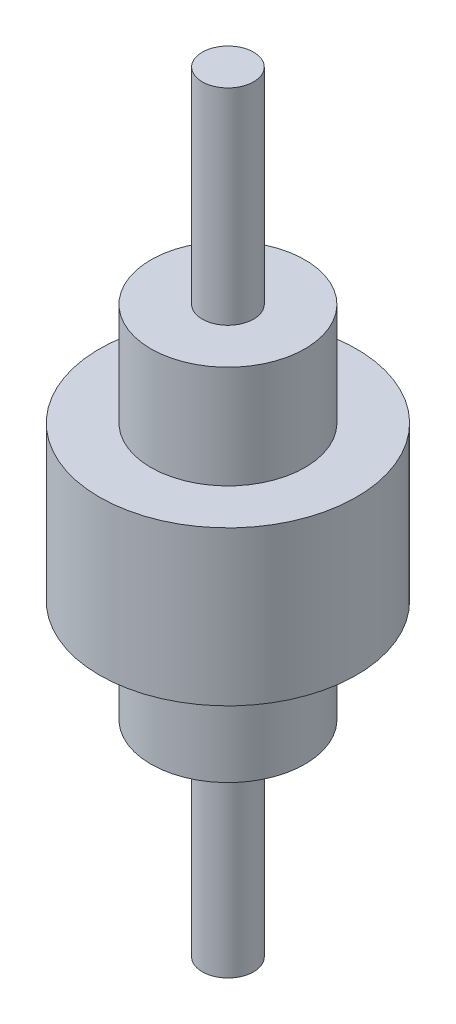
ISO-10303-21;
HEADER;
FILE_DESCRIPTION(('STEP AP214'),'2;1');
FILE_NAME('part.step','',(''),(''),'','','');
FILE_SCHEMA(('AUTOMOTIVE_DESIGN { 1 0 10303 214 1 1 1 1 }'));
ENDSEC;
DATA;
#1=APPLICATION_CONTEXT('core data for automotive mechanical design processes');
#2=APPLICATION_PROTOCOL_DEFINITION('international standard','automotive_design',2000,#1);
#3=PRODUCT_CONTEXT('',#1,'mechanical');
#4=PRODUCT('Part','Part','',(#3));
#5=PRODUCT_RELATED_PRODUCT_CATEGORY('part','',(#4));
#6=PRODUCT_DEFINITION_FORMATION('','',#4);
#7=PRODUCT_DEFINITION_CONTEXT('part definition',#1,'design');
#8=PRODUCT_DEFINITION('design','',#6,#7);
#9=PRODUCT_DEFINITION_SHAPE('','',#8);
#10=(LENGTH_UNIT() NAMED_UNIT(*) SI_UNIT(.MILLI.,.METRE.));
#11=(NAMED_UNIT(*) PLANE_ANGLE_UNIT() SI_UNIT($,.RADIAN.));
#12=(NAMED_UNIT(*) SI_UNIT($,.STERADIAN.) SOLID_ANGLE_UNIT());
#13=UNCERTAINTY_MEASURE_WITH_UNIT(LENGTH_MEASURE(1.E-05),#10,'distance_accuracy_value','');
#14=(GEOMETRIC_REPRESENTATION_CONTEXT(3) GLOBAL_UNCERTAINTY_ASSIGNED_CONTEXT((#13)) GLOBAL_UNIT_ASSIGNED_CONTEXT((#10,
#11,#12)) REPRESENTATION_CONTEXT('',''));
#15=CARTESIAN_POINT('',(0.,0.,0.));
#16=DIRECTION('',(0.,0.,1.));
#17=DIRECTION('',(1.,0.,0.));
#18=AXIS2_PLACEMENT_3D('',#15,#16,#17);
#19=CARTESIAN_POINT('',(0.,128.29705399691,0.));
#20=DIRECTION('',(0.,1.,0.));
#21=DIRECTION('',(0.,0.,1.));
#22=AXIS2_PLACEMENT_3D('',#19,#20,#21);
#23=CYLINDRICAL_SURFACE('',#22,50.);
#24=CARTESIAN_POINT('',(0.,8.29705399691023,0.));
#25=DIRECTION('',(0.,1.,0.));
#26=DIRECTION('',(0.,0.,1.));
#27=AXIS2_PLACEMENT_3D('',#24,#25,#26);
#28=CIRCLE('',#27,50.);
#29=CARTESIAN_POINT('',(0.,8.29705399691023,50.));
#30=VERTEX_POINT('',#29);
#31=EDGE_CURVE('E65',#30,#30,#28,.T.);
#32=ORIENTED_EDGE('',*,*,#31,.F.);
#33=EDGE_LOOP('',(#32));
#34=FACE_BOUND('',#33,.T.);
#35=CARTESIAN_POINT('',(0.,-51.7029460030898,0.));
#36=DIRECTION('',(0.,1.,0.));
#37=DIRECTION('',(0.,0.,1.));
#38=AXIS2_PLACEMENT_3D('',#35,#36,#37);
#39=CIRCLE('',#38,50.);
#40=CARTESIAN_POINT('',(0.,-51.7029460030898,50.));
#41=VERTEX_POINT('',#40);
#42=EDGE_CURVE('E10',#41,#41,#39,.T.);
#43=ORIENTED_EDGE('',*,*,#42,.T.);
#44=EDGE_LOOP('',(#43));
#45=FACE_BOUND('',#44,.T.);
#46=ADVANCED_FACE('F31',(#34,#45),#23,.T.);
#47=CARTESIAN_POINT('',(50.,-51.7029460030898,0.));
#48=DIRECTION('',(0.,1.,0.));
#49=DIRECTION('',(0.,0.,1.));
#50=AXIS2_PLACEMENT_3D('',#47,#48,#49);
#51=PLANE('',#50);
#52=ORIENTED_EDGE('',*,*,#42,.F.);
#53=EDGE_LOOP('',(#52));
#54=FACE_BOUND('',#53,.T.);
#55=CARTESIAN_POINT('',(0.,-51.7029460030898,0.));
#56=DIRECTION('',(0.,1.,0.));
#57=DIRECTION('',(0.,0.,1.));
#58=AXIS2_PLACEMENT_3D('',#55,#56,#57);
#59=CIRCLE('',#58,30.);
#60=CARTESIAN_POINT('',(0.,-51.7029460030898,30.));
#61=VERTEX_POINT('',#60);
#62=EDGE_CURVE('E37',#61,#61,#59,.T.);
#63=ORIENTED_EDGE('',*,*,#62,.T.);
#64=EDGE_LOOP('',(#63));
#65=FACE_BOUND('',#64,.T.);
#66=ADVANCED_FACE('F72',(#54,#65),#51,.F.);
#67=CARTESIAN_POINT('',(0.,128.29705399691,0.));
#68=DIRECTION('',(0.,1.,0.));
#69=DIRECTION('',(0.,0.,1.));
#70=AXIS2_PLACEMENT_3D('',#67,#68,#69);
#71=CYLINDRICAL_SURFACE('',#70,30.);
#72=ORIENTED_EDGE('',*,*,#62,.F.);
#73=EDGE_LOOP('',(#72));
#74=FACE_BOUND('',#73,.T.);
#75=CARTESIAN_POINT('',(0.,-91.7029460030898,0.));
#76=DIRECTION('',(0.,1.,0.));
#77=DIRECTION('',(0.,0.,1.));
#78=AXIS2_PLACEMENT_3D('',#75,#76,#77);
#79=CIRCLE('',#78,30.);
#80=CARTESIAN_POINT('',(0.,-91.7029460030898,30.));
#81=VERTEX_POINT('',#80);
#82=EDGE_CURVE('E41',#81,#81,#79,.T.);
#83=ORIENTED_EDGE('',*,*,#82,.T.);
#84=EDGE_LOOP('',(#83));
#85=FACE_BOUND('',#84,.T.);
#86=ADVANCED_FACE('F76',(#74,#85),#71,.T.);
#87=CARTESIAN_POINT('',(30.,-91.7029460030898,0.));
#88=DIRECTION('',(0.,1.,0.));
#89=DIRECTION('',(0.,0.,1.));
#90=AXIS2_PLACEMENT_3D('',#87,#88,#89);
#91=PLANE('',#90);
#92=ORIENTED_EDGE('',*,*,#82,.F.);
#93=EDGE_LOOP('',(#92));
#94=FACE_BOUND('',#93,.T.);
#95=CARTESIAN_POINT('',(0.,-91.7029460030898,0.));
#96=DIRECTION('',(0.,1.,0.));
#97=DIRECTION('',(0.,0.,1.));
#98=AXIS2_PLACEMENT_3D('',#95,#96,#97);
#99=CIRCLE('',#98,10.);
#100=CARTESIAN_POINT('',(0.,-91.7029460030898,10.));
#101=VERTEX_POINT('',#100);
#102=EDGE_CURVE('E45',#101,#101,#99,.T.);
#103=ORIENTED_EDGE('',*,*,#102,.T.);
#104=EDGE_LOOP('',(#103));
#105=FACE_BOUND('',#104,.T.);
#106=ADVANCED_FACE('F81',(#94,#105),#91,.F.);
#107=CARTESIAN_POINT('',(0.,128.29705399691,0.));
#108=DIRECTION('',(0.,1.,0.));
#109=DIRECTION('',(0.,0.,1.));
#110=AXIS2_PLACEMENT_3D('',#107,#108,#109);
#111=CYLINDRICAL_SURFACE('',#110,10.);
#112=ORIENTED_EDGE('',*,*,#102,.F.);
#113=EDGE_LOOP('',(#112));
#114=FACE_BOUND('',#113,.T.);
#115=CARTESIAN_POINT('',(0.,-171.70294600309,0.));
#116=DIRECTION('',(0.,1.,0.));
#117=DIRECTION('',(0.,0.,1.));
#118=AXIS2_PLACEMENT_3D('',#115,#116,#117);
#119=CIRCLE('',#118,10.);
#120=CARTESIAN_POINT('',(0.,-171.70294600309,10.));
#121=VERTEX_POINT('',#120);
#122=EDGE_CURVE('E50',#121,#121,#119,.T.);
#123=ORIENTED_EDGE('',*,*,#122,.T.);
#124=EDGE_LOOP('',(#123));
#125=FACE_BOUND('',#124,.T.);
#126=ADVANCED_FACE('F87',(#114,#125),#111,.T.);
#127=CARTESIAN_POINT('',(10.,-171.70294600309,0.));
#128=DIRECTION('',(0.,1.,0.));
#129=DIRECTION('',(0.,0.,1.));
#130=AXIS2_PLACEMENT_3D('',#127,#128,#129);
#131=PLANE('',#130);
#132=ORIENTED_EDGE('',*,*,#122,.F.);
#133=EDGE_LOOP('',(#132));
#134=FACE_BOUND('',#133,.T.);
#135=ADVANCED_FACE('F91',(#134),#131,.F.);
#136=CARTESIAN_POINT('',(10.,128.29705399691,0.));
#137=DIRECTION('',(0.,-1.,0.));
#138=DIRECTION('',(0.,0.,-1.));
#139=AXIS2_PLACEMENT_3D('',#136,#137,#138);
#140=PLANE('',#139);
#141=CARTESIAN_POINT('',(0.,128.29705399691,0.));
#142=DIRECTION('',(0.,1.,0.));
#143=DIRECTION('',(0.,0.,1.));
#144=AXIS2_PLACEMENT_3D('',#141,#142,#143);
#145=CIRCLE('',#144,10.);
#146=CARTESIAN_POINT('',(0.,128.29705399691,10.));
#147=VERTEX_POINT('',#146);
#148=EDGE_CURVE('E53',#147,#147,#145,.T.);
#149=ORIENTED_EDGE('',*,*,#148,.T.);
#150=EDGE_LOOP('',(#149));
#151=FACE_BOUND('',#150,.T.);
#152=ADVANCED_FACE('F95',(#151),#140,.F.);
#153=CARTESIAN_POINT('',(0.,128.29705399691,0.));
#154=DIRECTION('',(0.,1.,0.));
#155=DIRECTION('',(0.,0.,1.));
#156=AXIS2_PLACEMENT_3D('',#153,#154,#155);
#157=CYLINDRICAL_SURFACE('',#156,10.);
#158=ORIENTED_EDGE('',*,*,#148,.F.);
#159=EDGE_LOOP('',(#158));
#160=FACE_BOUND('',#159,.T.);
#161=CARTESIAN_POINT('',(0.,48.2970539969102,0.));
#162=DIRECTION('',(0.,1.,0.));
#163=DIRECTION('',(0.,0.,1.));
#164=AXIS2_PLACEMENT_3D('',#161,#162,#163);
#165=CIRCLE('',#164,10.);
#166=CARTESIAN_POINT('',(0.,48.2970539969102,10.));
#167=VERTEX_POINT('',#166);
#168=EDGE_CURVE('E56',#167,#167,#165,.T.);
#169=ORIENTED_EDGE('',*,*,#168,.T.);
#170=EDGE_LOOP('',(#169));
#171=FACE_BOUND('',#170,.T.);
#172=ADVANCED_FACE('F99',(#160,#171),#157,.T.);
#173=CARTESIAN_POINT('',(10.,48.2970539969102,0.));
#174=DIRECTION('',(0.,-1.,0.));
#175=DIRECTION('',(0.,0.,-1.));
#176=AXIS2_PLACEMENT_3D('',#173,#174,#175);
#177=PLANE('',#176);
#178=ORIENTED_EDGE('',*,*,#168,.F.);
#179=EDGE_LOOP('',(#178));
#180=FACE_BOUND('',#179,.T.);
#181=CARTESIAN_POINT('',(0.,48.2970539969102,0.));
#182=DIRECTION('',(0.,1.,0.));
#183=DIRECTION('',(0.,0.,1.));
#184=AXIS2_PLACEMENT_3D('',#181,#182,#183);
#185=CIRCLE('',#184,30.);
#186=CARTESIAN_POINT('',(0.,48.2970539969102,30.));
#187=VERTEX_POINT('',#186);
#188=EDGE_CURVE('E59',#187,#187,#185,.T.);
#189=ORIENTED_EDGE('',*,*,#188,.T.);
#190=EDGE_LOOP('',(#189));
#191=FACE_BOUND('',#190,.T.);
#192=ADVANCED_FACE('F103',(#180,#191),#177,.F.);
#193=CARTESIAN_POINT('',(0.,128.29705399691,0.));
#194=DIRECTION('',(0.,1.,0.));
#195=DIRECTION('',(0.,0.,1.));
#196=AXIS2_PLACEMENT_3D('',#193,#194,#195);
#197=CYLINDRICAL_SURFACE('',#196,30.);
#198=ORIENTED_EDGE('',*,*,#188,.F.);
#199=EDGE_LOOP('',(#198));
#200=FACE_BOUND('',#199,.T.);
#201=CARTESIAN_POINT('',(0.,8.29705399691023,0.));
#202=DIRECTION('',(0.,1.,0.));
#203=DIRECTION('',(0.,0.,1.));
#204=AXIS2_PLACEMENT_3D('',#201,#202,#203);
#205=CIRCLE('',#204,30.);
#206=CARTESIAN_POINT('',(0.,8.29705399691023,30.));
#207=VERTEX_POINT('',#206);
#208=EDGE_CURVE('E62',#207,#207,#205,.T.);
#209=ORIENTED_EDGE('',*,*,#208,.T.);
#210=EDGE_LOOP('',(#209));
#211=FACE_BOUND('',#210,.T.);
#212=ADVANCED_FACE('F107',(#200,#211),#197,.T.);
#213=CARTESIAN_POINT('',(30.,8.29705399691023,0.));
#214=DIRECTION('',(0.,-1.,0.));
#215=DIRECTION('',(0.,0.,-1.));
#216=AXIS2_PLACEMENT_3D('',#213,#214,#215);
#217=PLANE('',#216);
#218=ORIENTED_EDGE('',*,*,#208,.F.);
#219=EDGE_LOOP('',(#218));
#220=FACE_BOUND('',#219,.T.);
#221=ORIENTED_EDGE('',*,*,#31,.T.);
#222=EDGE_LOOP('',(#221));
#223=FACE_BOUND('',#222,.T.);
#224=ADVANCED_FACE('F69',(#220,#223),#217,.F.);
#225=CLOSED_SHELL('',(#46,#66,#86,#106,#126,#135,#152,#172,#192,#212,#224));
#226=MANIFOLD_SOLID_BREP('B2',#225);
#227=ADVANCED_BREP_SHAPE_REPRESENTATION('',(#18,#226),#14);
#228=SHAPE_DEFINITION_REPRESENTATION(#9,#227);
ENDSEC;
END-ISO-10303-21;
